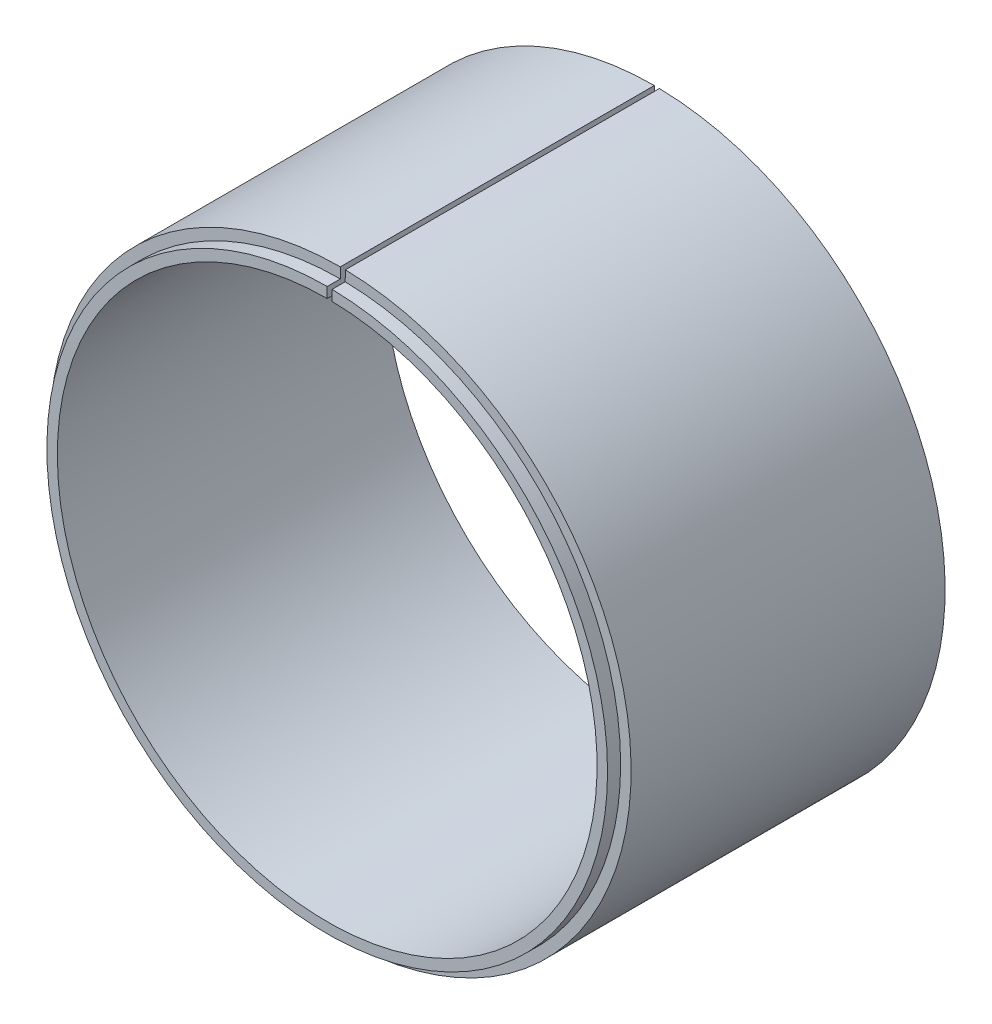
ISO-10303-21;
HEADER;
FILE_DESCRIPTION(('STEP AP214'),'2;1');
FILE_NAME('part.step','',(''),(''),'','','');
FILE_SCHEMA(('AUTOMOTIVE_DESIGN { 1 0 10303 214 1 1 1 1 }'));
ENDSEC;
DATA;
#1=APPLICATION_CONTEXT('core data for automotive mechanical design processes');
#2=APPLICATION_PROTOCOL_DEFINITION('international standard','automotive_design',2000,#1);
#3=PRODUCT_CONTEXT('',#1,'mechanical');
#4=PRODUCT('Part','Part','',(#3));
#5=PRODUCT_RELATED_PRODUCT_CATEGORY('part','',(#4));
#6=PRODUCT_DEFINITION_FORMATION('','',#4);
#7=PRODUCT_DEFINITION_CONTEXT('part definition',#1,'design');
#8=PRODUCT_DEFINITION('design','',#6,#7);
#9=PRODUCT_DEFINITION_SHAPE('','',#8);
#10=(LENGTH_UNIT() NAMED_UNIT(*) SI_UNIT(.MILLI.,.METRE.));
#11=(NAMED_UNIT(*) PLANE_ANGLE_UNIT() SI_UNIT($,.RADIAN.));
#12=(NAMED_UNIT(*) SI_UNIT($,.STERADIAN.) SOLID_ANGLE_UNIT());
#13=UNCERTAINTY_MEASURE_WITH_UNIT(LENGTH_MEASURE(1.E-05),#10,'distance_accuracy_value','');
#14=(GEOMETRIC_REPRESENTATION_CONTEXT(3) GLOBAL_UNCERTAINTY_ASSIGNED_CONTEXT((#13)) GLOBAL_UNIT_ASSIGNED_CONTEXT((#10,
#11,#12)) REPRESENTATION_CONTEXT('',''));
#15=CARTESIAN_POINT('',(0.,0.,0.));
#16=DIRECTION('',(0.,0.,1.));
#17=DIRECTION('',(1.,0.,0.));
#18=AXIS2_PLACEMENT_3D('',#15,#16,#17);
#19=CARTESIAN_POINT('',(0.,0.,48.));
#20=DIRECTION('',(0.,0.,-1.));
#21=DIRECTION('',(-1.,0.,0.));
#22=AXIS2_PLACEMENT_3D('',#19,#20,#21);
#23=PLANE('',#22);
#24=CARTESIAN_POINT('',(0.,0.,48.));
#25=DIRECTION('',(0.,0.,-1.));
#26=DIRECTION('',(1.,0.,0.));
#27=AXIS2_PLACEMENT_3D('',#24,#25,#26);
#28=CIRCLE('',#27,44.45);
#29=CARTESIAN_POINT('',(0.775759466136781,44.4432300497016,48.));
#30=VERTEX_POINT('',#29);
#31=CARTESIAN_POINT('',(0.,44.45,48.));
#32=VERTEX_POINT('',#31);
#33=EDGE_CURVE('E108',#30,#32,#28,.T.);
#34=ORIENTED_EDGE('',*,*,#33,.F.);
#35=DIRECTION('',(-0.0174524064372712,-0.999847695156392,0.));
#36=VECTOR('',#35,1.);
#37=CARTESIAN_POINT('',(0.775759466136781,44.4432300497016,48.));
#38=LINE('',#37,#36);
#39=CARTESIAN_POINT('',(0.747835615837147,42.8434737374514,48.));
#40=VERTEX_POINT('',#39);
#41=EDGE_CURVE('E90',#30,#40,#38,.T.);
#42=ORIENTED_EDGE('',*,*,#41,.T.);
#43=CARTESIAN_POINT('',(0.,0.,48.));
#44=DIRECTION('',(0.,0.,1.));
#45=DIRECTION('',(1.,0.,0.));
#46=AXIS2_PLACEMENT_3D('',#43,#44,#45);
#47=CIRCLE('',#46,42.85);
#48=CARTESIAN_POINT('',(0.,42.85,48.));
#49=VERTEX_POINT('',#48);
#50=EDGE_CURVE('E47',#49,#40,#47,.T.);
#51=ORIENTED_EDGE('',*,*,#50,.F.);
#52=DIRECTION('',(0.,-1.,0.));
#53=VECTOR('',#52,1.);
#54=CARTESIAN_POINT('',(0.,44.45,48.));
#55=LINE('',#54,#53);
#56=EDGE_CURVE('E137',#32,#49,#55,.T.);
#57=ORIENTED_EDGE('',*,*,#56,.F.);
#58=EDGE_LOOP('',(#34,#42,#51,#57));
#59=FACE_BOUND('',#58,.T.);
#60=ADVANCED_FACE('F44',(#59),#23,.F.);
#61=CARTESIAN_POINT('',(0.,0.,298.121407831452));
#62=DIRECTION('',(0.,0.,-1.));
#63=DIRECTION('',(-1.,0.,0.));
#64=AXIS2_PLACEMENT_3D('',#61,#62,#63);
#65=CYLINDRICAL_SURFACE('',#64,42.85);
#66=ORIENTED_EDGE('',*,*,#50,.T.);
#67=DIRECTION('',(0.,0.,1.));
#68=VECTOR('',#67,1.);
#69=CARTESIAN_POINT('',(0.747835615837147,42.8434737374514,48.));
#70=LINE('',#69,#68);
#71=CARTESIAN_POINT('',(0.747835615837157,42.8434737374514,50.));
#72=VERTEX_POINT('',#71);
#73=EDGE_CURVE('E111',#40,#72,#70,.T.);
#74=ORIENTED_EDGE('',*,*,#73,.T.);
#75=CARTESIAN_POINT('',(0.,0.,50.));
#76=DIRECTION('',(0.,0.,1.));
#77=DIRECTION('',(1.,0.,0.));
#78=AXIS2_PLACEMENT_3D('',#75,#76,#77);
#79=CIRCLE('',#78,42.85);
#80=CARTESIAN_POINT('',(0.,42.85,50.));
#81=VERTEX_POINT('',#80);
#82=EDGE_CURVE('E96',#81,#72,#79,.T.);
#83=ORIENTED_EDGE('',*,*,#82,.F.);
#84=DIRECTION('',(0.,0.,1.));
#85=VECTOR('',#84,1.);
#86=CARTESIAN_POINT('',(0.,42.85,48.));
#87=LINE('',#86,#85);
#88=EDGE_CURVE('E145',#49,#81,#87,.T.);
#89=ORIENTED_EDGE('',*,*,#88,.F.);
#90=EDGE_LOOP('',(#66,#74,#83,#89));
#91=FACE_BOUND('',#90,.T.);
#92=ADVANCED_FACE('F112',(#91),#65,.T.);
#93=CARTESIAN_POINT('',(0.,0.,298.121407831452));
#94=DIRECTION('',(0.,0.,-1.));
#95=DIRECTION('',(-1.,0.,0.));
#96=AXIS2_PLACEMENT_3D('',#93,#94,#95);
#97=CYLINDRICAL_SURFACE('',#96,44.45);
#98=CARTESIAN_POINT('',(0.,0.,0.));
#99=DIRECTION('',(0.,0.,1.));
#100=DIRECTION('',(-1.,0.,0.));
#101=AXIS2_PLACEMENT_3D('',#98,#99,#100);
#102=CIRCLE('',#101,44.45);
#103=CARTESIAN_POINT('',(0.,44.45,0.));
#104=VERTEX_POINT('',#103);
#105=CARTESIAN_POINT('',(0.775759466136781,44.4432300497016,0.));
#106=VERTEX_POINT('',#105);
#107=EDGE_CURVE('E114',#104,#106,#102,.T.);
#108=ORIENTED_EDGE('',*,*,#107,.T.);
#109=DIRECTION('',(0.,0.,1.));
#110=VECTOR('',#109,1.);
#111=CARTESIAN_POINT('',(0.775759466136781,44.4432300497016,48.));
#112=LINE('',#111,#110);
#113=EDGE_CURVE('E120',#106,#30,#112,.T.);
#114=ORIENTED_EDGE('',*,*,#113,.T.);
#115=ORIENTED_EDGE('',*,*,#33,.T.);
#116=DIRECTION('',(0.,0.,-1.));
#117=VECTOR('',#116,1.);
#118=CARTESIAN_POINT('',(0.,44.45,0.));
#119=LINE('',#118,#117);
#120=EDGE_CURVE('E132',#32,#104,#119,.T.);
#121=ORIENTED_EDGE('',*,*,#120,.T.);
#122=EDGE_LOOP('',(#108,#114,#115,#121));
#123=FACE_BOUND('',#122,.T.);
#124=ADVANCED_FACE('F131',(#123),#97,.T.);
#125=CARTESIAN_POINT('',(0.,0.,50.));
#126=DIRECTION('',(0.,0.,1.));
#127=DIRECTION('',(1.,0.,0.));
#128=AXIS2_PLACEMENT_3D('',#125,#126,#127);
#129=PLANE('',#128);
#130=DIRECTION('',(0.,-1.,0.));
#131=VECTOR('',#130,1.);
#132=CARTESIAN_POINT('',(0.,42.85,50.));
#133=LINE('',#132,#131);
#134=CARTESIAN_POINT('',(0.,41.25,50.));
#135=VERTEX_POINT('',#134);
#136=EDGE_CURVE('E104',#81,#135,#133,.T.);
#137=ORIENTED_EDGE('',*,*,#136,.F.);
#138=ORIENTED_EDGE('',*,*,#82,.T.);
#139=DIRECTION('',(-0.0174524064372731,-0.999847695156391,0.));
#140=VECTOR('',#139,1.);
#141=CARTESIAN_POINT('',(0.747835615837147,42.8434737374514,50.));
#142=LINE('',#141,#140);
#143=CARTESIAN_POINT('',(0.719911765537521,41.2437174252012,50.));
#144=VERTEX_POINT('',#143);
#145=EDGE_CURVE('E101',#72,#144,#142,.T.);
#146=ORIENTED_EDGE('',*,*,#145,.T.);
#147=CARTESIAN_POINT('',(0.,0.,50.));
#148=DIRECTION('',(0.,0.,1.));
#149=DIRECTION('',(1.,0.,0.));
#150=AXIS2_PLACEMENT_3D('',#147,#148,#149);
#151=CIRCLE('',#150,41.25);
#152=EDGE_CURVE('E138',#135,#144,#151,.T.);
#153=ORIENTED_EDGE('',*,*,#152,.F.);
#154=EDGE_LOOP('',(#137,#138,#146,#153));
#155=FACE_BOUND('',#154,.T.);
#156=ADVANCED_FACE('F98',(#155),#129,.T.);
#157=CARTESIAN_POINT('',(0.,0.,0.));
#158=DIRECTION('',(0.999847695156392,-0.0174524064372731,0.));
#159=DIRECTION('',(0.0174524064372731,0.999847695156391,0.));
#160=AXIS2_PLACEMENT_3D('',#157,#158,#159);
#161=PLANE('',#160);
#162=ORIENTED_EDGE('',*,*,#145,.F.);
#163=ORIENTED_EDGE('',*,*,#73,.F.);
#164=ORIENTED_EDGE('',*,*,#41,.F.);
#165=ORIENTED_EDGE('',*,*,#113,.F.);
#166=DIRECTION('',(0.0174524064372721,0.999847695156392,0.));
#167=VECTOR('',#166,1.);
#168=CARTESIAN_POINT('',(0.71991176553751,41.2437174252012,0.));
#169=LINE('',#168,#167);
#170=CARTESIAN_POINT('',(0.71991176553751,41.2437174252012,0.));
#171=VERTEX_POINT('',#170);
#172=EDGE_CURVE('E143',#171,#106,#169,.T.);
#173=ORIENTED_EDGE('',*,*,#172,.F.);
#174=DIRECTION('',(0.,0.,-1.));
#175=VECTOR('',#174,1.);
#176=CARTESIAN_POINT('',(0.71991176553751,41.2437174252012,50.));
#177=LINE('',#176,#175);
#178=EDGE_CURVE('E118',#144,#171,#177,.T.);
#179=ORIENTED_EDGE('',*,*,#178,.F.);
#180=EDGE_LOOP('',(#162,#163,#164,#165,#173,#179));
#181=FACE_BOUND('',#180,.T.);
#182=ADVANCED_FACE('F116',(#181),#161,.F.);
#183=CARTESIAN_POINT('',(0.,0.,0.));
#184=DIRECTION('',(0.,0.,1.));
#185=DIRECTION('',(1.,0.,0.));
#186=AXIS2_PLACEMENT_3D('',#183,#184,#185);
#187=PLANE('',#186);
#188=DIRECTION('',(0.,-1.,0.));
#189=VECTOR('',#188,1.);
#190=CARTESIAN_POINT('',(0.,44.45,0.));
#191=LINE('',#190,#189);
#192=CARTESIAN_POINT('',(0.,41.25,0.));
#193=VERTEX_POINT('',#192);
#194=EDGE_CURVE('E62',#104,#193,#191,.T.);
#195=ORIENTED_EDGE('',*,*,#194,.T.);
#196=CARTESIAN_POINT('',(0.,0.,0.));
#197=DIRECTION('',(0.,0.,-1.));
#198=DIRECTION('',(-1.,0.,0.));
#199=AXIS2_PLACEMENT_3D('',#196,#197,#198);
#200=CIRCLE('',#199,41.25);
#201=EDGE_CURVE('E53',#171,#193,#200,.T.);
#202=ORIENTED_EDGE('',*,*,#201,.F.);
#203=ORIENTED_EDGE('',*,*,#172,.T.);
#204=ORIENTED_EDGE('',*,*,#107,.F.);
#205=EDGE_LOOP('',(#195,#202,#203,#204));
#206=FACE_BOUND('',#205,.T.);
#207=ADVANCED_FACE('F148',(#206),#187,.F.);
#208=CARTESIAN_POINT('',(0.,0.,0.));
#209=DIRECTION('',(-1.,0.,0.));
#210=DIRECTION('',(0.,-1.,0.));
#211=AXIS2_PLACEMENT_3D('',#208,#209,#210);
#212=PLANE('',#211);
#213=ORIENTED_EDGE('',*,*,#56,.T.);
#214=ORIENTED_EDGE('',*,*,#88,.T.);
#215=ORIENTED_EDGE('',*,*,#136,.T.);
#216=DIRECTION('',(0.,0.,1.));
#217=VECTOR('',#216,1.);
#218=CARTESIAN_POINT('',(0.,41.25,0.));
#219=LINE('',#218,#217);
#220=EDGE_CURVE('E12',#193,#135,#219,.T.);
#221=ORIENTED_EDGE('',*,*,#220,.F.);
#222=ORIENTED_EDGE('',*,*,#194,.F.);
#223=ORIENTED_EDGE('',*,*,#120,.F.);
#224=EDGE_LOOP('',(#213,#214,#215,#221,#222,#223));
#225=FACE_BOUND('',#224,.T.);
#226=ADVANCED_FACE('F136',(#225),#212,.F.);
#227=CARTESIAN_POINT('',(0.,0.,298.121407831452));
#228=DIRECTION('',(0.,0.,-1.));
#229=DIRECTION('',(-1.,0.,0.));
#230=AXIS2_PLACEMENT_3D('',#227,#228,#229);
#231=CYLINDRICAL_SURFACE('',#230,41.25);
#232=ORIENTED_EDGE('',*,*,#201,.T.);
#233=ORIENTED_EDGE('',*,*,#220,.T.);
#234=ORIENTED_EDGE('',*,*,#152,.T.);
#235=ORIENTED_EDGE('',*,*,#178,.T.);
#236=EDGE_LOOP('',(#232,#233,#234,#235));
#237=FACE_BOUND('',#236,.T.);
#238=ADVANCED_FACE('F151',(#237),#231,.F.);
#239=CLOSED_SHELL('',(#60,#92,#124,#156,#182,#207,#226,#238));
#240=MANIFOLD_SOLID_BREP('B2',#239);
#241=ADVANCED_BREP_SHAPE_REPRESENTATION('',(#18,#240),#14);
#242=SHAPE_DEFINITION_REPRESENTATION(#9,#241);
ENDSEC;
END-ISO-10303-21;
